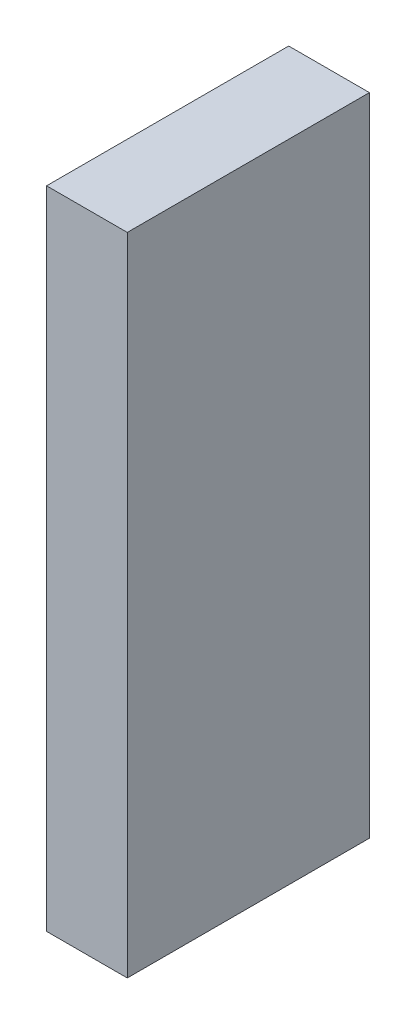
ISO-10303-21;
HEADER;
FILE_DESCRIPTION(('STEP AP214'),'2;1');
FILE_NAME('part.step','',(''),(''),'','','');
FILE_SCHEMA(('AUTOMOTIVE_DESIGN { 1 0 10303 214 1 1 1 1 }'));
ENDSEC;
DATA;
#1=APPLICATION_CONTEXT('core data for automotive mechanical design processes');
#2=APPLICATION_PROTOCOL_DEFINITION('international standard','automotive_design',2000,#1);
#3=PRODUCT_CONTEXT('',#1,'mechanical');
#4=PRODUCT('Part','Part','',(#3));
#5=PRODUCT_RELATED_PRODUCT_CATEGORY('part','',(#4));
#6=PRODUCT_DEFINITION_FORMATION('','',#4);
#7=PRODUCT_DEFINITION_CONTEXT('part definition',#1,'design');
#8=PRODUCT_DEFINITION('design','',#6,#7);
#9=PRODUCT_DEFINITION_SHAPE('','',#8);
#10=(LENGTH_UNIT() NAMED_UNIT(*) SI_UNIT(.MILLI.,.METRE.));
#11=(NAMED_UNIT(*) PLANE_ANGLE_UNIT() SI_UNIT($,.RADIAN.));
#12=(NAMED_UNIT(*) SI_UNIT($,.STERADIAN.) SOLID_ANGLE_UNIT());
#13=UNCERTAINTY_MEASURE_WITH_UNIT(LENGTH_MEASURE(1.E-05),#10,'distance_accuracy_value','');
#14=(GEOMETRIC_REPRESENTATION_CONTEXT(3) GLOBAL_UNCERTAINTY_ASSIGNED_CONTEXT((#13)) GLOBAL_UNIT_ASSIGNED_CONTEXT((#10,
#11,#12)) REPRESENTATION_CONTEXT('',''));
#15=CARTESIAN_POINT('',(0.,0.,0.));
#16=DIRECTION('',(0.,0.,1.));
#17=DIRECTION('',(1.,0.,0.));
#18=AXIS2_PLACEMENT_3D('',#15,#16,#17);
#19=CARTESIAN_POINT('',(3.175,-12.7,-4.7625));
#20=DIRECTION('',(0.,0.,1.));
#21=DIRECTION('',(1.,0.,0.));
#22=AXIS2_PLACEMENT_3D('',#19,#20,#21);
#23=PLANE('',#22);
#24=DIRECTION('',(0.,1.,0.));
#25=VECTOR('',#24,1.);
#26=CARTESIAN_POINT('',(0.,-12.7,-4.7625));
#27=LINE('',#26,#25);
#28=CARTESIAN_POINT('',(0.,-12.7,-4.7625));
#29=VERTEX_POINT('',#28);
#30=CARTESIAN_POINT('',(0.,12.7,-4.7625));
#31=VERTEX_POINT('',#30);
#32=EDGE_CURVE('E96',#29,#31,#27,.T.);
#33=ORIENTED_EDGE('',*,*,#32,.T.);
#34=DIRECTION('',(-1.,0.,0.));
#35=VECTOR('',#34,1.);
#36=CARTESIAN_POINT('',(3.175,12.7,-4.7625));
#37=LINE('',#36,#35);
#38=CARTESIAN_POINT('',(3.175,12.7,-4.7625));
#39=VERTEX_POINT('',#38);
#40=EDGE_CURVE('E11',#39,#31,#37,.T.);
#41=ORIENTED_EDGE('',*,*,#40,.F.);
#42=DIRECTION('',(0.,1.,0.));
#43=VECTOR('',#42,1.);
#44=CARTESIAN_POINT('',(3.175,-12.7,-4.7625));
#45=LINE('',#44,#43);
#46=CARTESIAN_POINT('',(3.175,-12.7,-4.7625));
#47=VERTEX_POINT('',#46);
#48=EDGE_CURVE('E84',#47,#39,#45,.T.);
#49=ORIENTED_EDGE('',*,*,#48,.F.);
#50=DIRECTION('',(-1.,0.,0.));
#51=VECTOR('',#50,1.);
#52=CARTESIAN_POINT('',(3.175,-12.7,-4.7625));
#53=LINE('',#52,#51);
#54=EDGE_CURVE('E92',#47,#29,#53,.T.);
#55=ORIENTED_EDGE('',*,*,#54,.T.);
#56=EDGE_LOOP('',(#33,#41,#49,#55));
#57=FACE_BOUND('',#56,.T.);
#58=ADVANCED_FACE('F33',(#57),#23,.F.);
#59=CARTESIAN_POINT('',(3.175,12.7,4.7625));
#60=DIRECTION('',(0.,-1.,0.));
#61=DIRECTION('',(0.,0.,-1.));
#62=AXIS2_PLACEMENT_3D('',#59,#60,#61);
#63=PLANE('',#62);
#64=DIRECTION('',(0.,0.,1.));
#65=VECTOR('',#64,1.);
#66=CARTESIAN_POINT('',(0.,12.7,4.7625));
#67=LINE('',#66,#65);
#68=CARTESIAN_POINT('',(0.,12.7,4.7625));
#69=VERTEX_POINT('',#68);
#70=EDGE_CURVE('E88',#31,#69,#67,.T.);
#71=ORIENTED_EDGE('',*,*,#70,.T.);
#72=DIRECTION('',(-1.,0.,0.));
#73=VECTOR('',#72,1.);
#74=CARTESIAN_POINT('',(3.175,12.7,4.7625));
#75=LINE('',#74,#73);
#76=CARTESIAN_POINT('',(3.175,12.7,4.7625));
#77=VERTEX_POINT('',#76);
#78=EDGE_CURVE('E41',#77,#69,#75,.T.);
#79=ORIENTED_EDGE('',*,*,#78,.F.);
#80=DIRECTION('',(0.,0.,1.));
#81=VECTOR('',#80,1.);
#82=CARTESIAN_POINT('',(3.175,12.7,4.7625));
#83=LINE('',#82,#81);
#84=EDGE_CURVE('E79',#39,#77,#83,.T.);
#85=ORIENTED_EDGE('',*,*,#84,.F.);
#86=ORIENTED_EDGE('',*,*,#40,.T.);
#87=EDGE_LOOP('',(#71,#79,#85,#86));
#88=FACE_BOUND('',#87,.T.);
#89=ADVANCED_FACE('F87',(#88),#63,.F.);
#90=CARTESIAN_POINT('',(3.175,-12.7,4.7625));
#91=DIRECTION('',(0.,0.,-1.));
#92=DIRECTION('',(-1.,0.,0.));
#93=AXIS2_PLACEMENT_3D('',#90,#91,#92);
#94=PLANE('',#93);
#95=DIRECTION('',(0.,-1.,0.));
#96=VECTOR('',#95,1.);
#97=CARTESIAN_POINT('',(0.,-12.7,4.7625));
#98=LINE('',#97,#96);
#99=CARTESIAN_POINT('',(0.,-12.7,4.7625));
#100=VERTEX_POINT('',#99);
#101=EDGE_CURVE('E66',#69,#100,#98,.T.);
#102=ORIENTED_EDGE('',*,*,#101,.T.);
#103=DIRECTION('',(-1.,0.,0.));
#104=VECTOR('',#103,1.);
#105=CARTESIAN_POINT('',(3.175,-12.7,4.7625));
#106=LINE('',#105,#104);
#107=CARTESIAN_POINT('',(3.175,-12.7,4.7625));
#108=VERTEX_POINT('',#107);
#109=EDGE_CURVE('E89',#108,#100,#106,.T.);
#110=ORIENTED_EDGE('',*,*,#109,.F.);
#111=DIRECTION('',(0.,-1.,0.));
#112=VECTOR('',#111,1.);
#113=CARTESIAN_POINT('',(3.175,-12.7,4.7625));
#114=LINE('',#113,#112);
#115=EDGE_CURVE('E82',#77,#108,#114,.T.);
#116=ORIENTED_EDGE('',*,*,#115,.F.);
#117=ORIENTED_EDGE('',*,*,#78,.T.);
#118=EDGE_LOOP('',(#102,#110,#116,#117));
#119=FACE_BOUND('',#118,.T.);
#120=ADVANCED_FACE('F90',(#119),#94,.F.);
#121=CARTESIAN_POINT('',(3.175,-12.7,4.7625));
#122=DIRECTION('',(0.,1.,0.));
#123=DIRECTION('',(0.,0.,1.));
#124=AXIS2_PLACEMENT_3D('',#121,#122,#123);
#125=PLANE('',#124);
#126=DIRECTION('',(0.,0.,-1.));
#127=VECTOR('',#126,1.);
#128=CARTESIAN_POINT('',(0.,-12.7,4.7625));
#129=LINE('',#128,#127);
#130=EDGE_CURVE('E72',#100,#29,#129,.T.);
#131=ORIENTED_EDGE('',*,*,#130,.T.);
#132=ORIENTED_EDGE('',*,*,#54,.F.);
#133=DIRECTION('',(0.,0.,-1.));
#134=VECTOR('',#133,1.);
#135=CARTESIAN_POINT('',(3.175,-12.7,4.7625));
#136=LINE('',#135,#134);
#137=EDGE_CURVE('E49',#108,#47,#136,.T.);
#138=ORIENTED_EDGE('',*,*,#137,.F.);
#139=ORIENTED_EDGE('',*,*,#109,.T.);
#140=EDGE_LOOP('',(#131,#132,#138,#139));
#141=FACE_BOUND('',#140,.T.);
#142=ADVANCED_FACE('F103',(#141),#125,.F.);
#143=CARTESIAN_POINT('',(3.175,12.7,-4.7625));
#144=DIRECTION('',(-1.,0.,0.));
#145=DIRECTION('',(0.,0.,1.));
#146=AXIS2_PLACEMENT_3D('',#143,#144,#145);
#147=PLANE('',#146);
#148=ORIENTED_EDGE('',*,*,#48,.T.);
#149=ORIENTED_EDGE('',*,*,#84,.T.);
#150=ORIENTED_EDGE('',*,*,#115,.T.);
#151=ORIENTED_EDGE('',*,*,#137,.T.);
#152=EDGE_LOOP('',(#148,#149,#150,#151));
#153=FACE_BOUND('',#152,.T.);
#154=ADVANCED_FACE('F80',(#153),#147,.F.);
#155=CARTESIAN_POINT('',(0.,12.7,-4.7625));
#156=DIRECTION('',(-1.,0.,0.));
#157=DIRECTION('',(0.,0.,1.));
#158=AXIS2_PLACEMENT_3D('',#155,#156,#157);
#159=PLANE('',#158);
#160=ORIENTED_EDGE('',*,*,#32,.F.);
#161=ORIENTED_EDGE('',*,*,#130,.F.);
#162=ORIENTED_EDGE('',*,*,#101,.F.);
#163=ORIENTED_EDGE('',*,*,#70,.F.);
#164=EDGE_LOOP('',(#160,#161,#162,#163));
#165=FACE_BOUND('',#164,.T.);
#166=ADVANCED_FACE('F106',(#165),#159,.T.);
#167=CLOSED_SHELL('',(#58,#89,#120,#142,#154,#166));
#168=MANIFOLD_SOLID_BREP('B2',#167);
#169=ADVANCED_BREP_SHAPE_REPRESENTATION('',(#18,#168),#14);
#170=SHAPE_DEFINITION_REPRESENTATION(#9,#169);
ENDSEC;
END-ISO-10303-21;
